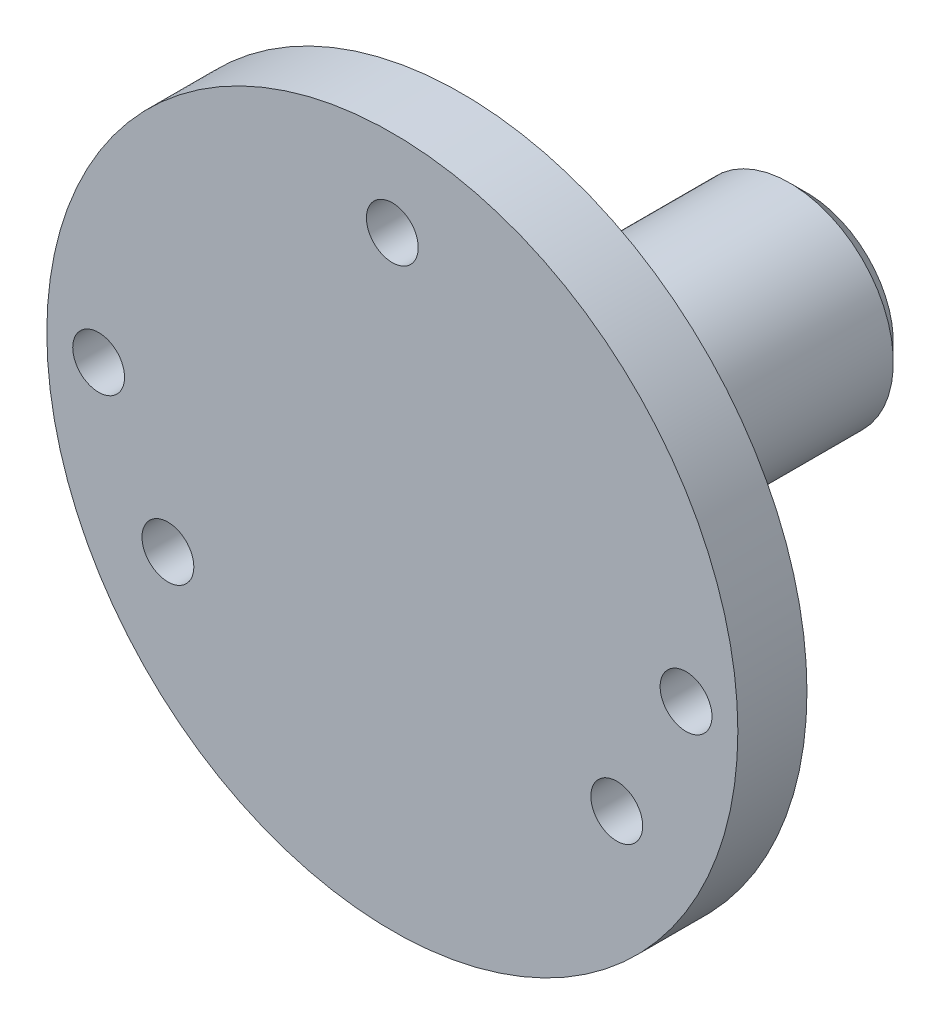
ISO-10303-21;
HEADER;
FILE_DESCRIPTION(('STEP AP214'),'2;1');
FILE_NAME('part.step','',(''),(''),'','','');
FILE_SCHEMA(('AUTOMOTIVE_DESIGN { 1 0 10303 214 1 1 1 1 }'));
ENDSEC;
DATA;
#1=APPLICATION_CONTEXT('core data for automotive mechanical design processes');
#2=APPLICATION_PROTOCOL_DEFINITION('international standard','automotive_design',2000,#1);
#3=PRODUCT_CONTEXT('',#1,'mechanical');
#4=PRODUCT('Part','Part','',(#3));
#5=PRODUCT_RELATED_PRODUCT_CATEGORY('part','',(#4));
#6=PRODUCT_DEFINITION_FORMATION('','',#4);
#7=PRODUCT_DEFINITION_CONTEXT('part definition',#1,'design');
#8=PRODUCT_DEFINITION('design','',#6,#7);
#9=PRODUCT_DEFINITION_SHAPE('','',#8);
#10=(LENGTH_UNIT() NAMED_UNIT(*) SI_UNIT(.MILLI.,.METRE.));
#11=(NAMED_UNIT(*) PLANE_ANGLE_UNIT() SI_UNIT($,.RADIAN.));
#12=(NAMED_UNIT(*) SI_UNIT($,.STERADIAN.) SOLID_ANGLE_UNIT());
#13=UNCERTAINTY_MEASURE_WITH_UNIT(LENGTH_MEASURE(1.E-05),#10,'distance_accuracy_value','');
#14=(GEOMETRIC_REPRESENTATION_CONTEXT(3) GLOBAL_UNCERTAINTY_ASSIGNED_CONTEXT((#13)) GLOBAL_UNIT_ASSIGNED_CONTEXT((#10,
#11,#12)) REPRESENTATION_CONTEXT('',''));
#15=CARTESIAN_POINT('',(0.,0.,0.));
#16=DIRECTION('',(0.,0.,1.));
#17=DIRECTION('',(1.,0.,0.));
#18=AXIS2_PLACEMENT_3D('',#15,#16,#17);
#19=CARTESIAN_POINT('',(0.,0.,2.));
#20=DIRECTION('',(0.,0.,-1.));
#21=DIRECTION('',(-1.,0.,0.));
#22=AXIS2_PLACEMENT_3D('',#19,#20,#21);
#23=CYLINDRICAL_SURFACE('',#22,10.);
#24=CARTESIAN_POINT('',(0.,0.,-2.));
#25=DIRECTION('',(0.,0.,-1.));
#26=DIRECTION('',(-1.,0.,0.));
#27=AXIS2_PLACEMENT_3D('',#24,#25,#26);
#28=CIRCLE('',#27,10.);
#29=CARTESIAN_POINT('',(-10.,0.,-2.));
#30=VERTEX_POINT('',#29);
#31=EDGE_CURVE('E54',#30,#30,#28,.T.);
#32=ORIENTED_EDGE('',*,*,#31,.F.);
#33=EDGE_LOOP('',(#32));
#34=FACE_BOUND('',#33,.T.);
#35=CARTESIAN_POINT('',(0.,0.,0.));
#36=DIRECTION('',(0.,0.,1.));
#37=DIRECTION('',(1.,0.,0.));
#38=AXIS2_PLACEMENT_3D('',#35,#36,#37);
#39=CIRCLE('',#38,10.);
#40=CARTESIAN_POINT('',(10.,0.,0.));
#41=VERTEX_POINT('',#40);
#42=EDGE_CURVE('E68',#41,#41,#39,.T.);
#43=ORIENTED_EDGE('',*,*,#42,.F.);
#44=EDGE_LOOP('',(#43));
#45=FACE_BOUND('',#44,.T.);
#46=ADVANCED_FACE('F33',(#34,#45),#23,.T.);
#47=CARTESIAN_POINT('',(-8.5,0.,2.001));
#48=DIRECTION('',(0.,0.,-1.));
#49=DIRECTION('',(-1.,0.,0.));
#50=AXIS2_PLACEMENT_3D('',#47,#48,#49);
#51=CYLINDRICAL_SURFACE('',#50,0.75);
#52=CARTESIAN_POINT('',(-8.5,0.,-2.));
#53=DIRECTION('',(0.,0.,-1.));
#54=DIRECTION('',(-1.,0.,0.));
#55=AXIS2_PLACEMENT_3D('',#52,#53,#54);
#56=CIRCLE('',#55,0.75);
#57=CARTESIAN_POINT('',(-9.25,0.,-2.));
#58=VERTEX_POINT('',#57);
#59=EDGE_CURVE('E58',#58,#58,#56,.T.);
#60=ORIENTED_EDGE('',*,*,#59,.T.);
#61=EDGE_LOOP('',(#60));
#62=FACE_BOUND('',#61,.T.);
#63=CARTESIAN_POINT('',(-8.5,0.,0.));
#64=DIRECTION('',(0.,0.,1.));
#65=DIRECTION('',(1.,0.,0.));
#66=AXIS2_PLACEMENT_3D('',#63,#64,#65);
#67=CIRCLE('',#66,0.75);
#68=CARTESIAN_POINT('',(-7.75,0.,0.));
#69=VERTEX_POINT('',#68);
#70=EDGE_CURVE('E75',#69,#69,#67,.F.);
#71=ORIENTED_EDGE('',*,*,#70,.F.);
#72=EDGE_LOOP('',(#71));
#73=FACE_BOUND('',#72,.T.);
#74=ADVANCED_FACE('F111',(#62,#73),#51,.F.);
#75=CARTESIAN_POINT('',(8.5,0.,2.001));
#76=DIRECTION('',(0.,0.,-1.));
#77=DIRECTION('',(-1.,0.,0.));
#78=AXIS2_PLACEMENT_3D('',#75,#76,#77);
#79=CYLINDRICAL_SURFACE('',#78,0.75);
#80=CARTESIAN_POINT('',(8.5,0.,-2.));
#81=DIRECTION('',(0.,0.,-1.));
#82=DIRECTION('',(-1.,0.,0.));
#83=AXIS2_PLACEMENT_3D('',#80,#81,#82);
#84=CIRCLE('',#83,0.75);
#85=CARTESIAN_POINT('',(7.75,0.,-2.));
#86=VERTEX_POINT('',#85);
#87=EDGE_CURVE('E57',#86,#86,#84,.T.);
#88=ORIENTED_EDGE('',*,*,#87,.T.);
#89=EDGE_LOOP('',(#88));
#90=FACE_BOUND('',#89,.T.);
#91=CARTESIAN_POINT('',(8.5,0.,0.));
#92=DIRECTION('',(0.,0.,1.));
#93=DIRECTION('',(1.,0.,0.));
#94=AXIS2_PLACEMENT_3D('',#91,#92,#93);
#95=CIRCLE('',#94,0.75);
#96=CARTESIAN_POINT('',(9.25,0.,0.));
#97=VERTEX_POINT('',#96);
#98=EDGE_CURVE('E78',#97,#97,#95,.F.);
#99=ORIENTED_EDGE('',*,*,#98,.F.);
#100=EDGE_LOOP('',(#99));
#101=FACE_BOUND('',#100,.T.);
#102=ADVANCED_FACE('F117',(#90,#101),#79,.F.);
#103=CARTESIAN_POINT('',(6.49519052838287,-3.75000000000083,28.001));
#104=DIRECTION('',(0.,0.,-1.));
#105=DIRECTION('',(-1.,0.,0.));
#106=AXIS2_PLACEMENT_3D('',#103,#104,#105);
#107=CYLINDRICAL_SURFACE('',#106,0.749999999999998);
#108=CARTESIAN_POINT('',(6.49519052838287,-3.75000000000083,-2.));
#109=DIRECTION('',(0.,0.,-1.));
#110=DIRECTION('',(-1.,0.,0.));
#111=AXIS2_PLACEMENT_3D('',#108,#109,#110);
#112=CIRCLE('',#111,0.749999999999998);
#113=CARTESIAN_POINT('',(5.74519052838287,-3.75000000000083,-2.));
#114=VERTEX_POINT('',#113);
#115=EDGE_CURVE('E64',#114,#114,#112,.T.);
#116=ORIENTED_EDGE('',*,*,#115,.T.);
#117=EDGE_LOOP('',(#116));
#118=FACE_BOUND('',#117,.T.);
#119=CARTESIAN_POINT('',(6.49519052838287,-3.75000000000083,0.));
#120=DIRECTION('',(0.,0.,1.));
#121=DIRECTION('',(1.,0.,0.));
#122=AXIS2_PLACEMENT_3D('',#119,#120,#121);
#123=CIRCLE('',#122,0.749999999999998);
#124=CARTESIAN_POINT('',(7.24519052838287,-3.75000000000083,0.));
#125=VERTEX_POINT('',#124);
#126=EDGE_CURVE('E81',#125,#125,#123,.F.);
#127=ORIENTED_EDGE('',*,*,#126,.F.);
#128=EDGE_LOOP('',(#127));
#129=FACE_BOUND('',#128,.T.);
#130=ADVANCED_FACE('F107',(#118,#129),#107,.F.);
#131=CARTESIAN_POINT('',(-6.49519052838421,-3.75000000000005,28.001));
#132=DIRECTION('',(0.,0.,-1.));
#133=DIRECTION('',(-1.,0.,0.));
#134=AXIS2_PLACEMENT_3D('',#131,#132,#133);
#135=CYLINDRICAL_SURFACE('',#134,0.750000000000001);
#136=CARTESIAN_POINT('',(-6.49519052838421,-3.75000000000005,-2.));
#137=DIRECTION('',(0.,0.,-1.));
#138=DIRECTION('',(-1.,0.,0.));
#139=AXIS2_PLACEMENT_3D('',#136,#137,#138);
#140=CIRCLE('',#139,0.750000000000001);
#141=CARTESIAN_POINT('',(-7.24519052838422,-3.75000000000005,-2.));
#142=VERTEX_POINT('',#141);
#143=EDGE_CURVE('E67',#142,#142,#140,.T.);
#144=ORIENTED_EDGE('',*,*,#143,.T.);
#145=EDGE_LOOP('',(#144));
#146=FACE_BOUND('',#145,.T.);
#147=CARTESIAN_POINT('',(-6.49519052838421,-3.75000000000005,0.));
#148=DIRECTION('',(0.,0.,1.));
#149=DIRECTION('',(1.,0.,0.));
#150=AXIS2_PLACEMENT_3D('',#147,#148,#149);
#151=CIRCLE('',#150,0.750000000000001);
#152=CARTESIAN_POINT('',(-5.74519052838421,-3.75000000000005,0.));
#153=VERTEX_POINT('',#152);
#154=EDGE_CURVE('E84',#153,#153,#151,.F.);
#155=ORIENTED_EDGE('',*,*,#154,.F.);
#156=EDGE_LOOP('',(#155));
#157=FACE_BOUND('',#156,.T.);
#158=ADVANCED_FACE('F97',(#146,#157),#135,.F.);
#159=CARTESIAN_POINT('',(0.,7.5,28.001));
#160=DIRECTION('',(0.,0.,-1.));
#161=DIRECTION('',(-1.,0.,0.));
#162=AXIS2_PLACEMENT_3D('',#159,#160,#161);
#163=CYLINDRICAL_SURFACE('',#162,0.749999999999999);
#164=CARTESIAN_POINT('',(0.,7.5,-2.));
#165=DIRECTION('',(0.,0.,-1.));
#166=DIRECTION('',(-1.,0.,0.));
#167=AXIS2_PLACEMENT_3D('',#164,#165,#166);
#168=CIRCLE('',#167,0.749999999999999);
#169=CARTESIAN_POINT('',(-0.749999999999999,7.5,-2.));
#170=VERTEX_POINT('',#169);
#171=EDGE_CURVE('E61',#170,#170,#168,.T.);
#172=ORIENTED_EDGE('',*,*,#171,.T.);
#173=EDGE_LOOP('',(#172));
#174=FACE_BOUND('',#173,.T.);
#175=CARTESIAN_POINT('',(0.,7.5,0.));
#176=DIRECTION('',(0.,0.,1.));
#177=DIRECTION('',(1.,0.,0.));
#178=AXIS2_PLACEMENT_3D('',#175,#176,#177);
#179=CIRCLE('',#178,0.749999999999999);
#180=CARTESIAN_POINT('',(0.749999999999999,7.5,0.));
#181=VERTEX_POINT('',#180);
#182=EDGE_CURVE('E38',#181,#181,#179,.F.);
#183=ORIENTED_EDGE('',*,*,#182,.F.);
#184=EDGE_LOOP('',(#183));
#185=FACE_BOUND('',#184,.T.);
#186=ADVANCED_FACE('F94',(#174,#185),#163,.F.);
#187=CARTESIAN_POINT('',(0.,0.,-2.));
#188=DIRECTION('',(0.,0.,-1.));
#189=DIRECTION('',(-1.,0.,0.));
#190=AXIS2_PLACEMENT_3D('',#187,#188,#189);
#191=PLANE('',#190);
#192=ORIENTED_EDGE('',*,*,#171,.F.);
#193=EDGE_LOOP('',(#192));
#194=FACE_BOUND('',#193,.T.);
#195=ORIENTED_EDGE('',*,*,#143,.F.);
#196=EDGE_LOOP('',(#195));
#197=FACE_BOUND('',#196,.T.);
#198=ORIENTED_EDGE('',*,*,#115,.F.);
#199=EDGE_LOOP('',(#198));
#200=FACE_BOUND('',#199,.T.);
#201=ORIENTED_EDGE('',*,*,#87,.F.);
#202=EDGE_LOOP('',(#201));
#203=FACE_BOUND('',#202,.T.);
#204=ORIENTED_EDGE('',*,*,#59,.F.);
#205=EDGE_LOOP('',(#204));
#206=FACE_BOUND('',#205,.T.);
#207=CARTESIAN_POINT('',(0.,0.,-2.));
#208=DIRECTION('',(0.,0.,-1.));
#209=DIRECTION('',(-1.,0.,0.));
#210=AXIS2_PLACEMENT_3D('',#207,#208,#209);
#211=CIRCLE('',#210,3.99999999999999);
#212=CARTESIAN_POINT('',(-3.99999999999999,0.,-2.));
#213=VERTEX_POINT('',#212);
#214=EDGE_CURVE('E46',#213,#213,#211,.F.);
#215=ORIENTED_EDGE('',*,*,#214,.T.);
#216=EDGE_LOOP('',(#215));
#217=FACE_BOUND('',#216,.T.);
#218=ORIENTED_EDGE('',*,*,#31,.T.);
#219=EDGE_LOOP('',(#218));
#220=FACE_BOUND('',#219,.T.);
#221=ADVANCED_FACE('F96',(#194,#197,#200,#203,#206,#217,#220),#191,.T.);
#222=CARTESIAN_POINT('',(0.,0.,-12.));
#223=DIRECTION('',(0.,0.,1.));
#224=DIRECTION('',(1.,0.,0.));
#225=AXIS2_PLACEMENT_3D('',#222,#223,#224);
#226=CYLINDRICAL_SURFACE('',#225,3.);
#227=CARTESIAN_POINT('',(0.,0.,-11.5));
#228=DIRECTION('',(0.,0.,-1.));
#229=DIRECTION('',(-1.,0.,0.));
#230=AXIS2_PLACEMENT_3D('',#227,#228,#229);
#231=CIRCLE('',#230,3.);
#232=CARTESIAN_POINT('',(-3.,0.,-11.5));
#233=VERTEX_POINT('',#232);
#234=EDGE_CURVE('E10',#233,#233,#231,.F.);
#235=ORIENTED_EDGE('',*,*,#234,.T.);
#236=EDGE_LOOP('',(#235));
#237=FACE_BOUND('',#236,.T.);
#238=CARTESIAN_POINT('',(0.,0.,-3.00000000000001));
#239=DIRECTION('',(0.,0.,-1.));
#240=DIRECTION('',(-1.,0.,0.));
#241=AXIS2_PLACEMENT_3D('',#238,#239,#240);
#242=CIRCLE('',#241,3.);
#243=CARTESIAN_POINT('',(-3.,0.,-3.00000000000001));
#244=VERTEX_POINT('',#243);
#245=EDGE_CURVE('E51',#244,#244,#242,.T.);
#246=ORIENTED_EDGE('',*,*,#245,.T.);
#247=EDGE_LOOP('',(#246));
#248=FACE_BOUND('',#247,.T.);
#249=ADVANCED_FACE('F104',(#237,#248),#226,.T.);
#250=CARTESIAN_POINT('',(0.,0.,-12.));
#251=DIRECTION('',(0.,0.,-1.));
#252=DIRECTION('',(-1.,0.,0.));
#253=AXIS2_PLACEMENT_3D('',#250,#251,#252);
#254=PLANE('',#253);
#255=CARTESIAN_POINT('',(0.,0.,-12.));
#256=DIRECTION('',(0.,0.,-1.));
#257=DIRECTION('',(-1.,0.,0.));
#258=AXIS2_PLACEMENT_3D('',#255,#256,#257);
#259=CIRCLE('',#258,2.5);
#260=CARTESIAN_POINT('',(-2.5,0.,-12.));
#261=VERTEX_POINT('',#260);
#262=EDGE_CURVE('E42',#261,#261,#259,.T.);
#263=ORIENTED_EDGE('',*,*,#262,.T.);
#264=EDGE_LOOP('',(#263));
#265=FACE_BOUND('',#264,.T.);
#266=ADVANCED_FACE('F128',(#265),#254,.T.);
#267=CARTESIAN_POINT('',(0.,0.,-3.00000000000001));
#268=DIRECTION('',(0.,0.,1.));
#269=DIRECTION('',(1.,0.,0.));
#270=AXIS2_PLACEMENT_3D('',#267,#268,#269);
#271=CONICAL_SURFACE('',#270,3.,0.785398163397441);
#272=ORIENTED_EDGE('',*,*,#214,.F.);
#273=EDGE_LOOP('',(#272));
#274=FACE_BOUND('',#273,.T.);
#275=ORIENTED_EDGE('',*,*,#245,.F.);
#276=EDGE_LOOP('',(#275));
#277=FACE_BOUND('',#276,.T.);
#278=ADVANCED_FACE('F124',(#274,#277),#271,.T.);
#279=CARTESIAN_POINT('',(0.,0.,-12.));
#280=DIRECTION('',(0.,0.,1.));
#281=DIRECTION('',(1.,0.,0.));
#282=AXIS2_PLACEMENT_3D('',#279,#280,#281);
#283=CONICAL_SURFACE('',#282,2.5,0.785398163397448);
#284=ORIENTED_EDGE('',*,*,#234,.F.);
#285=EDGE_LOOP('',(#284));
#286=FACE_BOUND('',#285,.T.);
#287=ORIENTED_EDGE('',*,*,#262,.F.);
#288=EDGE_LOOP('',(#287));
#289=FACE_BOUND('',#288,.T.);
#290=ADVANCED_FACE('F36',(#286,#289),#283,.T.);
#291=CARTESIAN_POINT('',(0.,0.,0.));
#292=DIRECTION('',(0.,0.,-1.));
#293=DIRECTION('',(-1.,0.,0.));
#294=AXIS2_PLACEMENT_3D('',#291,#292,#293);
#295=PLANE('',#294);
#296=ORIENTED_EDGE('',*,*,#70,.T.);
#297=EDGE_LOOP('',(#296));
#298=FACE_BOUND('',#297,.T.);
#299=ORIENTED_EDGE('',*,*,#98,.T.);
#300=EDGE_LOOP('',(#299));
#301=FACE_BOUND('',#300,.T.);
#302=ORIENTED_EDGE('',*,*,#126,.T.);
#303=EDGE_LOOP('',(#302));
#304=FACE_BOUND('',#303,.T.);
#305=ORIENTED_EDGE('',*,*,#154,.T.);
#306=EDGE_LOOP('',(#305));
#307=FACE_BOUND('',#306,.T.);
#308=ORIENTED_EDGE('',*,*,#182,.T.);
#309=EDGE_LOOP('',(#308));
#310=FACE_BOUND('',#309,.T.);
#311=ORIENTED_EDGE('',*,*,#42,.T.);
#312=EDGE_LOOP('',(#311));
#313=FACE_BOUND('',#312,.T.);
#314=ADVANCED_FACE('F91',(#298,#301,#304,#307,#310,#313),#295,.F.);
#315=CLOSED_SHELL('',(#46,#74,#102,#130,#158,#186,#221,#249,#266,#278,#290,#314));
#316=MANIFOLD_SOLID_BREP('B2',#315);
#317=ADVANCED_BREP_SHAPE_REPRESENTATION('',(#18,#316),#14);
#318=SHAPE_DEFINITION_REPRESENTATION(#9,#317);
ENDSEC;
END-ISO-10303-21;
